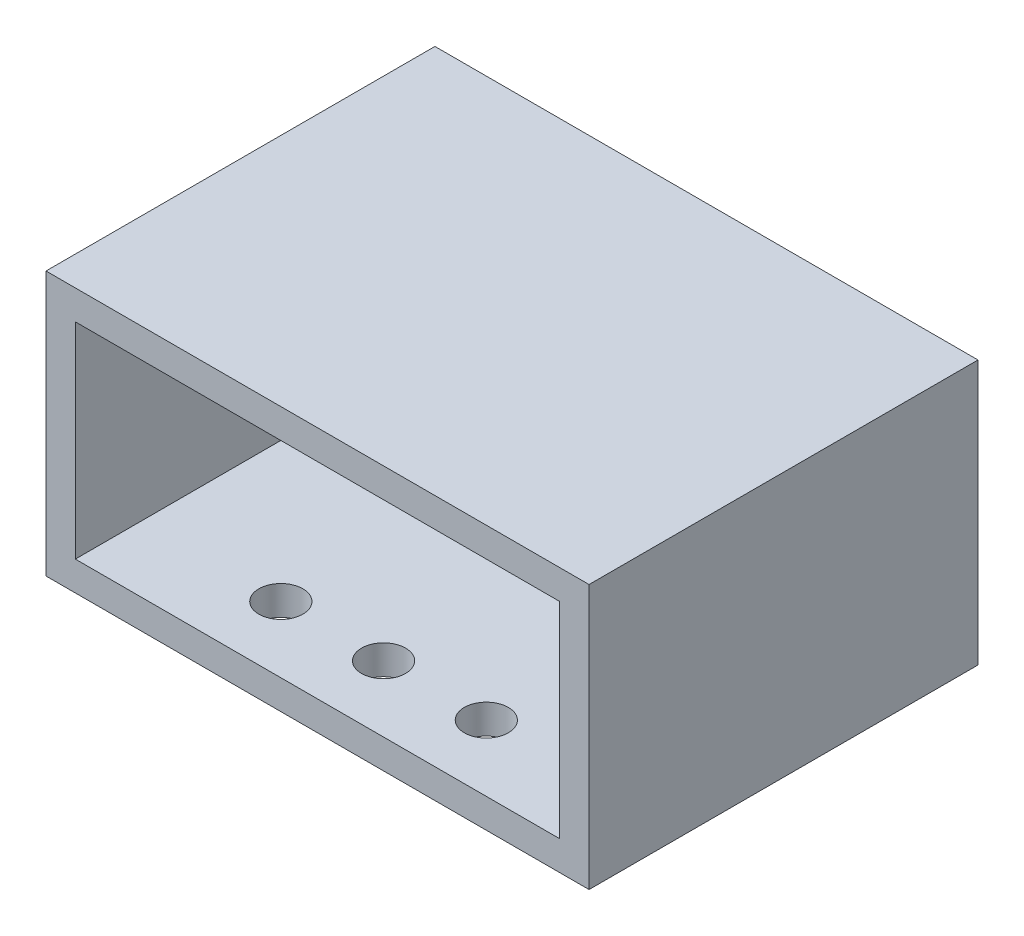
ISO-10303-21;
HEADER;
FILE_DESCRIPTION(('STEP AP214'),'2;1');
FILE_NAME('part.step','',(''),(''),'','','');
FILE_SCHEMA(('AUTOMOTIVE_DESIGN { 1 0 10303 214 1 1 1 1 }'));
ENDSEC;
DATA;
#1=APPLICATION_CONTEXT('core data for automotive mechanical design processes');
#2=APPLICATION_PROTOCOL_DEFINITION('international standard','automotive_design',2000,#1);
#3=PRODUCT_CONTEXT('',#1,'mechanical');
#4=PRODUCT('Part','Part','',(#3));
#5=PRODUCT_RELATED_PRODUCT_CATEGORY('part','',(#4));
#6=PRODUCT_DEFINITION_FORMATION('','',#4);
#7=PRODUCT_DEFINITION_CONTEXT('part definition',#1,'design');
#8=PRODUCT_DEFINITION('design','',#6,#7);
#9=PRODUCT_DEFINITION_SHAPE('','',#8);
#10=(LENGTH_UNIT() NAMED_UNIT(*) SI_UNIT(.MILLI.,.METRE.));
#11=(NAMED_UNIT(*) PLANE_ANGLE_UNIT() SI_UNIT($,.RADIAN.));
#12=(NAMED_UNIT(*) SI_UNIT($,.STERADIAN.) SOLID_ANGLE_UNIT());
#13=UNCERTAINTY_MEASURE_WITH_UNIT(LENGTH_MEASURE(1.E-05),#10,'distance_accuracy_value','');
#14=(GEOMETRIC_REPRESENTATION_CONTEXT(3) GLOBAL_UNCERTAINTY_ASSIGNED_CONTEXT((#13)) GLOBAL_UNIT_ASSIGNED_CONTEXT((#10,
#11,#12)) REPRESENTATION_CONTEXT('',''));
#15=CARTESIAN_POINT('',(0.,0.,0.));
#16=DIRECTION('',(0.,0.,1.));
#17=DIRECTION('',(1.,0.,0.));
#18=AXIS2_PLACEMENT_3D('',#15,#16,#17);
#19=CARTESIAN_POINT('',(18.5,18.,13.25));
#20=DIRECTION('',(-1.,0.,0.));
#21=DIRECTION('',(0.,0.,1.));
#22=AXIS2_PLACEMENT_3D('',#19,#20,#21);
#23=PLANE('',#22);
#24=DIRECTION('',(0.,0.,-1.));
#25=VECTOR('',#24,1.);
#26=CARTESIAN_POINT('',(18.5,0.,13.25));
#27=LINE('',#26,#25);
#28=CARTESIAN_POINT('',(18.5,0.,13.25));
#29=VERTEX_POINT('',#28);
#30=CARTESIAN_POINT('',(18.5,0.,-13.25));
#31=VERTEX_POINT('',#30);
#32=EDGE_CURVE('E154',#29,#31,#27,.T.);
#33=ORIENTED_EDGE('',*,*,#32,.T.);
#34=DIRECTION('',(0.,-1.,0.));
#35=VECTOR('',#34,1.);
#36=CARTESIAN_POINT('',(18.5,18.,-13.25));
#37=LINE('',#36,#35);
#38=CARTESIAN_POINT('',(18.5,18.,-13.25));
#39=VERTEX_POINT('',#38);
#40=EDGE_CURVE('E191',#39,#31,#37,.T.);
#41=ORIENTED_EDGE('',*,*,#40,.F.);
#42=DIRECTION('',(0.,0.,-1.));
#43=VECTOR('',#42,1.);
#44=CARTESIAN_POINT('',(18.5,18.,13.25));
#45=LINE('',#44,#43);
#46=CARTESIAN_POINT('',(18.5,18.,13.25));
#47=VERTEX_POINT('',#46);
#48=EDGE_CURVE('E160',#47,#39,#45,.T.);
#49=ORIENTED_EDGE('',*,*,#48,.F.);
#50=DIRECTION('',(0.,-1.,0.));
#51=VECTOR('',#50,1.);
#52=CARTESIAN_POINT('',(18.5,18.,13.25));
#53=LINE('',#52,#51);
#54=EDGE_CURVE('E170',#47,#29,#53,.T.);
#55=ORIENTED_EDGE('',*,*,#54,.T.);
#56=EDGE_LOOP('',(#33,#41,#49,#55));
#57=FACE_BOUND('',#56,.T.);
#58=ADVANCED_FACE('F39',(#57),#23,.F.);
#59=CARTESIAN_POINT('',(-18.5,18.,-13.25));
#60=DIRECTION('',(0.,0.,1.));
#61=DIRECTION('',(1.,0.,0.));
#62=AXIS2_PLACEMENT_3D('',#59,#60,#61);
#63=PLANE('',#62);
#64=DIRECTION('',(-1.,0.,0.));
#65=VECTOR('',#64,1.);
#66=CARTESIAN_POINT('',(-18.5,0.,-13.25));
#67=LINE('',#66,#65);
#68=CARTESIAN_POINT('',(-18.5,0.,-13.25));
#69=VERTEX_POINT('',#68);
#70=EDGE_CURVE('E174',#31,#69,#67,.T.);
#71=ORIENTED_EDGE('',*,*,#70,.T.);
#72=DIRECTION('',(0.,-1.,0.));
#73=VECTOR('',#72,1.);
#74=CARTESIAN_POINT('',(-18.5,18.,-13.25));
#75=LINE('',#74,#73);
#76=CARTESIAN_POINT('',(-18.5,18.,-13.25));
#77=VERTEX_POINT('',#76);
#78=EDGE_CURVE('E187',#77,#69,#75,.T.);
#79=ORIENTED_EDGE('',*,*,#78,.F.);
#80=DIRECTION('',(-1.,0.,0.));
#81=VECTOR('',#80,1.);
#82=CARTESIAN_POINT('',(-18.5,18.,-13.25));
#83=LINE('',#82,#81);
#84=EDGE_CURVE('E94',#39,#77,#83,.T.);
#85=ORIENTED_EDGE('',*,*,#84,.F.);
#86=ORIENTED_EDGE('',*,*,#40,.T.);
#87=EDGE_LOOP('',(#71,#79,#85,#86));
#88=FACE_BOUND('',#87,.T.);
#89=ADVANCED_FACE('F266',(#88),#63,.F.);
#90=CARTESIAN_POINT('',(-18.5,18.,13.25));
#91=DIRECTION('',(1.,0.,0.));
#92=DIRECTION('',(0.,0.,-1.));
#93=AXIS2_PLACEMENT_3D('',#90,#91,#92);
#94=PLANE('',#93);
#95=DIRECTION('',(0.,0.,1.));
#96=VECTOR('',#95,1.);
#97=CARTESIAN_POINT('',(-18.5,0.,13.25));
#98=LINE('',#97,#96);
#99=CARTESIAN_POINT('',(-18.5,0.,13.25));
#100=VERTEX_POINT('',#99);
#101=EDGE_CURVE('E177',#69,#100,#98,.T.);
#102=ORIENTED_EDGE('',*,*,#101,.T.);
#103=DIRECTION('',(0.,-1.,0.));
#104=VECTOR('',#103,1.);
#105=CARTESIAN_POINT('',(-18.5,18.,13.25));
#106=LINE('',#105,#104);
#107=CARTESIAN_POINT('',(-18.5,18.,13.25));
#108=VERTEX_POINT('',#107);
#109=EDGE_CURVE('E184',#108,#100,#106,.T.);
#110=ORIENTED_EDGE('',*,*,#109,.F.);
#111=DIRECTION('',(0.,0.,1.));
#112=VECTOR('',#111,1.);
#113=CARTESIAN_POINT('',(-18.5,18.,13.25));
#114=LINE('',#113,#112);
#115=EDGE_CURVE('E165',#77,#108,#114,.T.);
#116=ORIENTED_EDGE('',*,*,#115,.F.);
#117=ORIENTED_EDGE('',*,*,#78,.T.);
#118=EDGE_LOOP('',(#102,#110,#116,#117));
#119=FACE_BOUND('',#118,.T.);
#120=ADVANCED_FACE('F265',(#119),#94,.F.);
#121=CARTESIAN_POINT('',(-18.5,18.,13.25));
#122=DIRECTION('',(0.,0.,-1.));
#123=DIRECTION('',(-1.,0.,0.));
#124=AXIS2_PLACEMENT_3D('',#121,#122,#123);
#125=PLANE('',#124);
#126=DIRECTION('',(-1.,0.,0.));
#127=VECTOR('',#126,1.);
#128=CARTESIAN_POINT('',(-18.5,2.,13.25));
#129=LINE('',#128,#127);
#130=CARTESIAN_POINT('',(16.5,2.,13.25));
#131=VERTEX_POINT('',#130);
#132=CARTESIAN_POINT('',(-16.5,2.,13.25));
#133=VERTEX_POINT('',#132);
#134=EDGE_CURVE('E48',#131,#133,#129,.T.);
#135=ORIENTED_EDGE('',*,*,#134,.T.);
#136=DIRECTION('',(0.,1.,0.));
#137=VECTOR('',#136,1.);
#138=CARTESIAN_POINT('',(-16.5,18.,13.25));
#139=LINE('',#138,#137);
#140=CARTESIAN_POINT('',(-16.5,16.,13.25));
#141=VERTEX_POINT('',#140);
#142=EDGE_CURVE('E11',#133,#141,#139,.T.);
#143=ORIENTED_EDGE('',*,*,#142,.T.);
#144=DIRECTION('',(1.,0.,0.));
#145=VECTOR('',#144,1.);
#146=CARTESIAN_POINT('',(-18.5,16.,13.25));
#147=LINE('',#146,#145);
#148=CARTESIAN_POINT('',(16.5,16.,13.25));
#149=VERTEX_POINT('',#148);
#150=EDGE_CURVE('E119',#141,#149,#147,.T.);
#151=ORIENTED_EDGE('',*,*,#150,.T.);
#152=DIRECTION('',(0.,-1.,0.));
#153=VECTOR('',#152,1.);
#154=CARTESIAN_POINT('',(16.5,18.,13.25));
#155=LINE('',#154,#153);
#156=EDGE_CURVE('E196',#149,#131,#155,.T.);
#157=ORIENTED_EDGE('',*,*,#156,.T.);
#158=EDGE_LOOP('',(#135,#143,#151,#157));
#159=FACE_BOUND('',#158,.T.);
#160=DIRECTION('',(1.,0.,0.));
#161=VECTOR('',#160,1.);
#162=CARTESIAN_POINT('',(-18.5,0.,13.25));
#163=LINE('',#162,#161);
#164=EDGE_CURVE('E86',#100,#29,#163,.T.);
#165=ORIENTED_EDGE('',*,*,#164,.T.);
#166=ORIENTED_EDGE('',*,*,#54,.F.);
#167=DIRECTION('',(1.,0.,0.));
#168=VECTOR('',#167,1.);
#169=CARTESIAN_POINT('',(-18.5,18.,13.25));
#170=LINE('',#169,#168);
#171=EDGE_CURVE('E65',#108,#47,#170,.T.);
#172=ORIENTED_EDGE('',*,*,#171,.F.);
#173=ORIENTED_EDGE('',*,*,#109,.T.);
#174=EDGE_LOOP('',(#165,#166,#172,#173));
#175=FACE_BOUND('',#174,.T.);
#176=ADVANCED_FACE('F261',(#159,#175),#125,.F.);
#177=CARTESIAN_POINT('',(0.,18.,0.));
#178=DIRECTION('',(0.,-1.,0.));
#179=DIRECTION('',(0.,0.,-1.));
#180=AXIS2_PLACEMENT_3D('',#177,#178,#179);
#181=PLANE('',#180);
#182=ORIENTED_EDGE('',*,*,#48,.T.);
#183=ORIENTED_EDGE('',*,*,#84,.T.);
#184=ORIENTED_EDGE('',*,*,#115,.T.);
#185=ORIENTED_EDGE('',*,*,#171,.T.);
#186=EDGE_LOOP('',(#182,#183,#184,#185));
#187=FACE_BOUND('',#186,.T.);
#188=ADVANCED_FACE('F251',(#187),#181,.F.);
#189=CARTESIAN_POINT('',(0.,0.,0.));
#190=DIRECTION('',(0.,-1.,0.));
#191=DIRECTION('',(0.,0.,-1.));
#192=AXIS2_PLACEMENT_3D('',#189,#190,#191);
#193=PLANE('',#192);
#194=CARTESIAN_POINT('',(-7.,0.,-8.75));
#195=DIRECTION('',(0.,-1.,0.));
#196=DIRECTION('',(0.,0.,-1.));
#197=AXIS2_PLACEMENT_3D('',#194,#195,#196);
#198=CIRCLE('',#197,1.5);
#199=CARTESIAN_POINT('',(-7.,0.,-10.25));
#200=VERTEX_POINT('',#199);
#201=EDGE_CURVE('E208',#200,#200,#198,.F.);
#202=ORIENTED_EDGE('',*,*,#201,.T.);
#203=EDGE_LOOP('',(#202));
#204=FACE_BOUND('',#203,.T.);
#205=CARTESIAN_POINT('',(7.,0.,-8.75));
#206=DIRECTION('',(0.,-1.,0.));
#207=DIRECTION('',(0.,0.,-1.));
#208=AXIS2_PLACEMENT_3D('',#205,#206,#207);
#209=CIRCLE('',#208,1.5);
#210=CARTESIAN_POINT('',(7.,0.,-10.25));
#211=VERTEX_POINT('',#210);
#212=EDGE_CURVE('E224',#211,#211,#209,.F.);
#213=ORIENTED_EDGE('',*,*,#212,.T.);
#214=EDGE_LOOP('',(#213));
#215=FACE_BOUND('',#214,.T.);
#216=CARTESIAN_POINT('',(0.,0.,-8.75));
#217=DIRECTION('',(0.,-1.,0.));
#218=DIRECTION('',(0.,0.,-1.));
#219=AXIS2_PLACEMENT_3D('',#216,#217,#218);
#220=CIRCLE('',#219,1.5);
#221=CARTESIAN_POINT('',(0.,0.,-10.25));
#222=VERTEX_POINT('',#221);
#223=EDGE_CURVE('E220',#222,#222,#220,.F.);
#224=ORIENTED_EDGE('',*,*,#223,.T.);
#225=EDGE_LOOP('',(#224));
#226=FACE_BOUND('',#225,.T.);
#227=CARTESIAN_POINT('',(-7.,0.,8.75));
#228=DIRECTION('',(0.,-1.,0.));
#229=DIRECTION('',(0.,0.,-1.));
#230=AXIS2_PLACEMENT_3D('',#227,#228,#229);
#231=CIRCLE('',#230,1.5);
#232=CARTESIAN_POINT('',(-7.,0.,7.25));
#233=VERTEX_POINT('',#232);
#234=EDGE_CURVE('E140',#233,#233,#231,.T.);
#235=ORIENTED_EDGE('',*,*,#234,.F.);
#236=EDGE_LOOP('',(#235));
#237=FACE_BOUND('',#236,.T.);
#238=CARTESIAN_POINT('',(7.,0.,8.75));
#239=DIRECTION('',(0.,-1.,0.));
#240=DIRECTION('',(0.,0.,-1.));
#241=AXIS2_PLACEMENT_3D('',#238,#239,#240);
#242=CIRCLE('',#241,1.5);
#243=CARTESIAN_POINT('',(7.,0.,7.25));
#244=VERTEX_POINT('',#243);
#245=EDGE_CURVE('E213',#244,#244,#242,.T.);
#246=ORIENTED_EDGE('',*,*,#245,.F.);
#247=EDGE_LOOP('',(#246));
#248=FACE_BOUND('',#247,.T.);
#249=CARTESIAN_POINT('',(0.,0.,8.75));
#250=DIRECTION('',(0.,-1.,0.));
#251=DIRECTION('',(0.,0.,-1.));
#252=AXIS2_PLACEMENT_3D('',#249,#250,#251);
#253=CIRCLE('',#252,1.5);
#254=CARTESIAN_POINT('',(0.,0.,7.25));
#255=VERTEX_POINT('',#254);
#256=EDGE_CURVE('E207',#255,#255,#253,.T.);
#257=ORIENTED_EDGE('',*,*,#256,.F.);
#258=EDGE_LOOP('',(#257));
#259=FACE_BOUND('',#258,.T.);
#260=ORIENTED_EDGE('',*,*,#32,.F.);
#261=ORIENTED_EDGE('',*,*,#164,.F.);
#262=ORIENTED_EDGE('',*,*,#101,.F.);
#263=ORIENTED_EDGE('',*,*,#70,.F.);
#264=EDGE_LOOP('',(#260,#261,#262,#263));
#265=FACE_BOUND('',#264,.T.);
#266=ADVANCED_FACE('F248',(#204,#215,#226,#237,#248,#259,#265),#193,.T.);
#267=CARTESIAN_POINT('',(-16.5,2.,16.75));
#268=DIRECTION('',(-1.,0.,0.));
#269=DIRECTION('',(0.,0.,1.));
#270=AXIS2_PLACEMENT_3D('',#267,#268,#269);
#271=PLANE('',#270);
#272=DIRECTION('',(0.,0.,-1.));
#273=VECTOR('',#272,1.);
#274=CARTESIAN_POINT('',(-16.5,2.,16.75));
#275=LINE('',#274,#273);
#276=CARTESIAN_POINT('',(-16.5,2.,-11.25));
#277=VERTEX_POINT('',#276);
#278=EDGE_CURVE('E138',#133,#277,#275,.T.);
#279=ORIENTED_EDGE('',*,*,#278,.T.);
#280=DIRECTION('',(0.,1.,0.));
#281=VECTOR('',#280,1.);
#282=CARTESIAN_POINT('',(-16.5,2.,-11.25));
#283=LINE('',#282,#281);
#284=CARTESIAN_POINT('',(-16.5,16.,-11.25));
#285=VERTEX_POINT('',#284);
#286=EDGE_CURVE('E130',#277,#285,#283,.T.);
#287=ORIENTED_EDGE('',*,*,#286,.T.);
#288=DIRECTION('',(0.,0.,-1.));
#289=VECTOR('',#288,1.);
#290=CARTESIAN_POINT('',(-16.5,16.,16.75));
#291=LINE('',#290,#289);
#292=EDGE_CURVE('E114',#141,#285,#291,.T.);
#293=ORIENTED_EDGE('',*,*,#292,.F.);
#294=ORIENTED_EDGE('',*,*,#142,.F.);
#295=EDGE_LOOP('',(#279,#287,#293,#294));
#296=FACE_BOUND('',#295,.T.);
#297=ADVANCED_FACE('F136',(#296),#271,.F.);
#298=CARTESIAN_POINT('',(16.5,2.,16.75));
#299=DIRECTION('',(0.,-1.,0.));
#300=DIRECTION('',(0.,0.,-1.));
#301=AXIS2_PLACEMENT_3D('',#298,#299,#300);
#302=PLANE('',#301);
#303=CARTESIAN_POINT('',(-7.,2.,-8.75));
#304=DIRECTION('',(0.,-1.,0.));
#305=DIRECTION('',(0.,0.,-1.));
#306=AXIS2_PLACEMENT_3D('',#303,#304,#305);
#307=CIRCLE('',#306,1.5);
#308=CARTESIAN_POINT('',(-7.,2.,-10.25));
#309=VERTEX_POINT('',#308);
#310=EDGE_CURVE('E42',#309,#309,#307,.F.);
#311=ORIENTED_EDGE('',*,*,#310,.F.);
#312=EDGE_LOOP('',(#311));
#313=FACE_BOUND('',#312,.T.);
#314=CARTESIAN_POINT('',(7.,2.,-8.75));
#315=DIRECTION('',(0.,-1.,0.));
#316=DIRECTION('',(0.,0.,-1.));
#317=AXIS2_PLACEMENT_3D('',#314,#315,#316);
#318=CIRCLE('',#317,1.5);
#319=CARTESIAN_POINT('',(7.,2.,-10.25));
#320=VERTEX_POINT('',#319);
#321=EDGE_CURVE('E221',#320,#320,#318,.F.);
#322=ORIENTED_EDGE('',*,*,#321,.F.);
#323=EDGE_LOOP('',(#322));
#324=FACE_BOUND('',#323,.T.);
#325=CARTESIAN_POINT('',(0.,2.,-8.75));
#326=DIRECTION('',(0.,-1.,0.));
#327=DIRECTION('',(0.,0.,-1.));
#328=AXIS2_PLACEMENT_3D('',#325,#326,#327);
#329=CIRCLE('',#328,1.5);
#330=CARTESIAN_POINT('',(0.,2.,-10.25));
#331=VERTEX_POINT('',#330);
#332=EDGE_CURVE('E217',#331,#331,#329,.F.);
#333=ORIENTED_EDGE('',*,*,#332,.F.);
#334=EDGE_LOOP('',(#333));
#335=FACE_BOUND('',#334,.T.);
#336=CARTESIAN_POINT('',(-7.,2.,8.75));
#337=DIRECTION('',(0.,-1.,0.));
#338=DIRECTION('',(0.,0.,-1.));
#339=AXIS2_PLACEMENT_3D('',#336,#337,#338);
#340=CIRCLE('',#339,1.5);
#341=CARTESIAN_POINT('',(-7.,2.,7.25));
#342=VERTEX_POINT('',#341);
#343=EDGE_CURVE('E144',#342,#342,#340,.T.);
#344=ORIENTED_EDGE('',*,*,#343,.T.);
#345=EDGE_LOOP('',(#344));
#346=FACE_BOUND('',#345,.T.);
#347=CARTESIAN_POINT('',(7.,2.,8.75));
#348=DIRECTION('',(0.,-1.,0.));
#349=DIRECTION('',(0.,0.,-1.));
#350=AXIS2_PLACEMENT_3D('',#347,#348,#349);
#351=CIRCLE('',#350,1.5);
#352=CARTESIAN_POINT('',(7.,2.,7.25));
#353=VERTEX_POINT('',#352);
#354=EDGE_CURVE('E209',#353,#353,#351,.T.);
#355=ORIENTED_EDGE('',*,*,#354,.T.);
#356=EDGE_LOOP('',(#355));
#357=FACE_BOUND('',#356,.T.);
#358=CARTESIAN_POINT('',(0.,2.,8.75));
#359=DIRECTION('',(0.,-1.,0.));
#360=DIRECTION('',(0.,0.,-1.));
#361=AXIS2_PLACEMENT_3D('',#358,#359,#360);
#362=CIRCLE('',#361,1.5);
#363=CARTESIAN_POINT('',(0.,2.,7.25));
#364=VERTEX_POINT('',#363);
#365=EDGE_CURVE('E203',#364,#364,#362,.T.);
#366=ORIENTED_EDGE('',*,*,#365,.T.);
#367=EDGE_LOOP('',(#366));
#368=FACE_BOUND('',#367,.T.);
#369=DIRECTION('',(0.,0.,-1.));
#370=VECTOR('',#369,1.);
#371=CARTESIAN_POINT('',(16.5,2.,16.75));
#372=LINE('',#371,#370);
#373=CARTESIAN_POINT('',(16.5,2.,-11.25));
#374=VERTEX_POINT('',#373);
#375=EDGE_CURVE('E155',#131,#374,#372,.T.);
#376=ORIENTED_EDGE('',*,*,#375,.T.);
#377=DIRECTION('',(-1.,0.,0.));
#378=VECTOR('',#377,1.);
#379=CARTESIAN_POINT('',(16.5,2.,-11.25));
#380=LINE('',#379,#378);
#381=EDGE_CURVE('E123',#374,#277,#380,.T.);
#382=ORIENTED_EDGE('',*,*,#381,.T.);
#383=ORIENTED_EDGE('',*,*,#278,.F.);
#384=ORIENTED_EDGE('',*,*,#134,.F.);
#385=EDGE_LOOP('',(#376,#382,#383,#384));
#386=FACE_BOUND('',#385,.T.);
#387=ADVANCED_FACE('F281',(#313,#324,#335,#346,#357,#368,#386),#302,.F.);
#388=CARTESIAN_POINT('',(16.5,2.,16.75));
#389=DIRECTION('',(1.,0.,0.));
#390=DIRECTION('',(0.,0.,-1.));
#391=AXIS2_PLACEMENT_3D('',#388,#389,#390);
#392=PLANE('',#391);
#393=DIRECTION('',(0.,0.,-1.));
#394=VECTOR('',#393,1.);
#395=CARTESIAN_POINT('',(16.5,16.,16.75));
#396=LINE('',#395,#394);
#397=CARTESIAN_POINT('',(16.5,16.,-11.25));
#398=VERTEX_POINT('',#397);
#399=EDGE_CURVE('E56',#149,#398,#396,.T.);
#400=ORIENTED_EDGE('',*,*,#399,.T.);
#401=DIRECTION('',(0.,-1.,0.));
#402=VECTOR('',#401,1.);
#403=CARTESIAN_POINT('',(16.5,2.,-11.25));
#404=LINE('',#403,#402);
#405=EDGE_CURVE('E133',#398,#374,#404,.T.);
#406=ORIENTED_EDGE('',*,*,#405,.T.);
#407=ORIENTED_EDGE('',*,*,#375,.F.);
#408=ORIENTED_EDGE('',*,*,#156,.F.);
#409=EDGE_LOOP('',(#400,#406,#407,#408));
#410=FACE_BOUND('',#409,.T.);
#411=ADVANCED_FACE('F284',(#410),#392,.F.);
#412=CARTESIAN_POINT('',(16.5,16.,16.75));
#413=DIRECTION('',(0.,1.,0.));
#414=DIRECTION('',(0.,0.,1.));
#415=AXIS2_PLACEMENT_3D('',#412,#413,#414);
#416=PLANE('',#415);
#417=ORIENTED_EDGE('',*,*,#292,.T.);
#418=DIRECTION('',(1.,0.,0.));
#419=VECTOR('',#418,1.);
#420=CARTESIAN_POINT('',(16.5,16.,-11.25));
#421=LINE('',#420,#419);
#422=EDGE_CURVE('E117',#285,#398,#421,.T.);
#423=ORIENTED_EDGE('',*,*,#422,.T.);
#424=ORIENTED_EDGE('',*,*,#399,.F.);
#425=ORIENTED_EDGE('',*,*,#150,.F.);
#426=EDGE_LOOP('',(#417,#423,#424,#425));
#427=FACE_BOUND('',#426,.T.);
#428=ADVANCED_FACE('F116',(#427),#416,.F.);
#429=CARTESIAN_POINT('',(0.,0.,-11.25));
#430=DIRECTION('',(0.,0.,1.));
#431=DIRECTION('',(1.,0.,0.));
#432=AXIS2_PLACEMENT_3D('',#429,#430,#431);
#433=PLANE('',#432);
#434=ORIENTED_EDGE('',*,*,#286,.F.);
#435=ORIENTED_EDGE('',*,*,#381,.F.);
#436=ORIENTED_EDGE('',*,*,#405,.F.);
#437=ORIENTED_EDGE('',*,*,#422,.F.);
#438=EDGE_LOOP('',(#434,#435,#436,#437));
#439=FACE_BOUND('',#438,.T.);
#440=ADVANCED_FACE('F128',(#439),#433,.T.);
#441=CARTESIAN_POINT('',(0.,4.,8.75));
#442=DIRECTION('',(0.,-1.,0.));
#443=DIRECTION('',(0.,0.,-1.));
#444=AXIS2_PLACEMENT_3D('',#441,#442,#443);
#445=CYLINDRICAL_SURFACE('',#444,1.5);
#446=ORIENTED_EDGE('',*,*,#256,.T.);
#447=EDGE_LOOP('',(#446));
#448=FACE_BOUND('',#447,.T.);
#449=ORIENTED_EDGE('',*,*,#365,.F.);
#450=EDGE_LOOP('',(#449));
#451=FACE_BOUND('',#450,.T.);
#452=ADVANCED_FACE('F293',(#448,#451),#445,.F.);
#453=CARTESIAN_POINT('',(7.,4.,8.75));
#454=DIRECTION('',(0.,-1.,0.));
#455=DIRECTION('',(0.,0.,-1.));
#456=AXIS2_PLACEMENT_3D('',#453,#454,#455);
#457=CYLINDRICAL_SURFACE('',#456,1.5);
#458=ORIENTED_EDGE('',*,*,#245,.T.);
#459=EDGE_LOOP('',(#458));
#460=FACE_BOUND('',#459,.T.);
#461=ORIENTED_EDGE('',*,*,#354,.F.);
#462=EDGE_LOOP('',(#461));
#463=FACE_BOUND('',#462,.T.);
#464=ADVANCED_FACE('F245',(#460,#463),#457,.F.);
#465=CARTESIAN_POINT('',(-7.,4.,8.75));
#466=DIRECTION('',(0.,-1.,0.));
#467=DIRECTION('',(0.,0.,-1.));
#468=AXIS2_PLACEMENT_3D('',#465,#466,#467);
#469=CYLINDRICAL_SURFACE('',#468,1.5);
#470=ORIENTED_EDGE('',*,*,#234,.T.);
#471=EDGE_LOOP('',(#470));
#472=FACE_BOUND('',#471,.T.);
#473=ORIENTED_EDGE('',*,*,#343,.F.);
#474=EDGE_LOOP('',(#473));
#475=FACE_BOUND('',#474,.T.);
#476=ADVANCED_FACE('F299',(#472,#475),#469,.F.);
#477=CARTESIAN_POINT('',(0.,4.,-8.75));
#478=DIRECTION('',(0.,-1.,0.));
#479=DIRECTION('',(0.,0.,-1.));
#480=AXIS2_PLACEMENT_3D('',#477,#478,#479);
#481=CYLINDRICAL_SURFACE('',#480,1.5);
#482=ORIENTED_EDGE('',*,*,#223,.F.);
#483=EDGE_LOOP('',(#482));
#484=FACE_BOUND('',#483,.T.);
#485=ORIENTED_EDGE('',*,*,#332,.T.);
#486=EDGE_LOOP('',(#485));
#487=FACE_BOUND('',#486,.T.);
#488=ADVANCED_FACE('F302',(#484,#487),#481,.F.);
#489=CARTESIAN_POINT('',(7.,4.,-8.75));
#490=DIRECTION('',(0.,-1.,0.));
#491=DIRECTION('',(0.,0.,-1.));
#492=AXIS2_PLACEMENT_3D('',#489,#490,#491);
#493=CYLINDRICAL_SURFACE('',#492,1.5);
#494=ORIENTED_EDGE('',*,*,#212,.F.);
#495=EDGE_LOOP('',(#494));
#496=FACE_BOUND('',#495,.T.);
#497=ORIENTED_EDGE('',*,*,#321,.T.);
#498=EDGE_LOOP('',(#497));
#499=FACE_BOUND('',#498,.T.);
#500=ADVANCED_FACE('F306',(#496,#499),#493,.F.);
#501=CARTESIAN_POINT('',(-7.,4.,-8.75));
#502=DIRECTION('',(0.,-1.,0.));
#503=DIRECTION('',(0.,0.,-1.));
#504=AXIS2_PLACEMENT_3D('',#501,#502,#503);
#505=CYLINDRICAL_SURFACE('',#504,1.5);
#506=ORIENTED_EDGE('',*,*,#201,.F.);
#507=EDGE_LOOP('',(#506));
#508=FACE_BOUND('',#507,.T.);
#509=ORIENTED_EDGE('',*,*,#310,.T.);
#510=EDGE_LOOP('',(#509));
#511=FACE_BOUND('',#510,.T.);
#512=ADVANCED_FACE('F310',(#508,#511),#505,.F.);
#513=CLOSED_SHELL('',(#58,#89,#120,#176,#188,#266,#297,#387,#411,#428,#440,#452,#464,#476,#488,
#500,#512));
#514=MANIFOLD_SOLID_BREP('B2',#513);
#515=ADVANCED_BREP_SHAPE_REPRESENTATION('',(#18,#514),#14);
#516=SHAPE_DEFINITION_REPRESENTATION(#9,#515);
ENDSEC;
END-ISO-10303-21;
